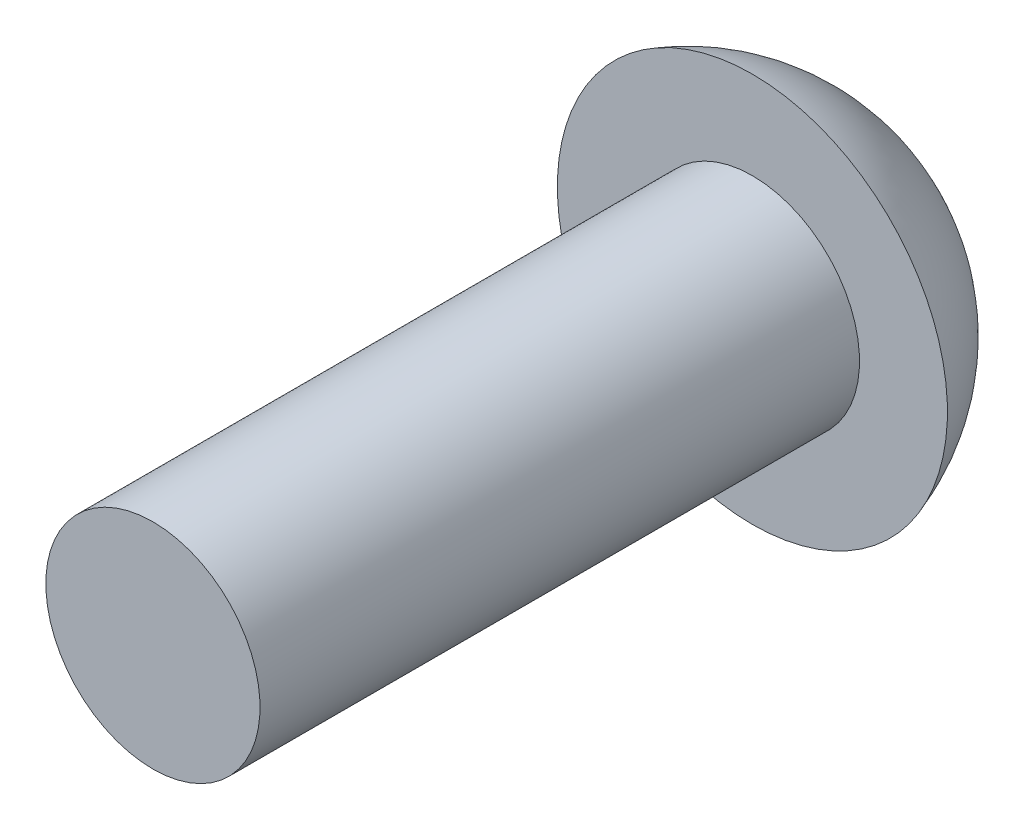
ISO-10303-21;
HEADER;
FILE_DESCRIPTION(('STEP AP214'),'2;1');
FILE_NAME('part.step','',(''),(''),'','','');
FILE_SCHEMA(('AUTOMOTIVE_DESIGN { 1 0 10303 214 1 1 1 1 }'));
ENDSEC;
DATA;
#1=APPLICATION_CONTEXT('core data for automotive mechanical design processes');
#2=APPLICATION_PROTOCOL_DEFINITION('international standard','automotive_design',2000,#1);
#3=PRODUCT_CONTEXT('',#1,'mechanical');
#4=PRODUCT('Part','Part','',(#3));
#5=PRODUCT_RELATED_PRODUCT_CATEGORY('part','',(#4));
#6=PRODUCT_DEFINITION_FORMATION('','',#4);
#7=PRODUCT_DEFINITION_CONTEXT('part definition',#1,'design');
#8=PRODUCT_DEFINITION('design','',#6,#7);
#9=PRODUCT_DEFINITION_SHAPE('','',#8);
#10=(LENGTH_UNIT() NAMED_UNIT(*) SI_UNIT(.MILLI.,.METRE.));
#11=(NAMED_UNIT(*) PLANE_ANGLE_UNIT() SI_UNIT($,.RADIAN.));
#12=(NAMED_UNIT(*) SI_UNIT($,.STERADIAN.) SOLID_ANGLE_UNIT());
#13=UNCERTAINTY_MEASURE_WITH_UNIT(LENGTH_MEASURE(1.E-05),#10,'distance_accuracy_value','');
#14=(GEOMETRIC_REPRESENTATION_CONTEXT(3) GLOBAL_UNCERTAINTY_ASSIGNED_CONTEXT((#13)) GLOBAL_UNIT_ASSIGNED_CONTEXT((#10,
#11,#12)) REPRESENTATION_CONTEXT('',''));
#15=CARTESIAN_POINT('',(0.,0.,0.));
#16=DIRECTION('',(0.,0.,1.));
#17=DIRECTION('',(1.,0.,0.));
#18=AXIS2_PLACEMENT_3D('',#15,#16,#17);
#19=CARTESIAN_POINT('',(0.,0.,-8.49456818181818));
#20=DIRECTION('',(0.,0.,1.));
#21=DIRECTION('',(0.,1.,0.));
#22=AXIS2_PLACEMENT_3D('',#19,#20,#21);
#23=SPHERICAL_SURFACE('',#22,3.26563181818182);
#24=CARTESIAN_POINT('',(0.,0.,-9.525));
#25=DIRECTION('',(0.,0.,1.));
#26=DIRECTION('',(0.,-1.,0.));
#27=AXIS2_PLACEMENT_3D('',#24,#25,#26);
#28=CIRCLE('',#27,3.0988);
#29=CARTESIAN_POINT('',(0.,-3.0988,-9.525));
#30=VERTEX_POINT('',#29);
#31=EDGE_CURVE('E10',#30,#30,#28,.T.);
#32=ORIENTED_EDGE('',*,*,#31,.F.);
#33=EDGE_LOOP('',(#32));
#34=FACE_BOUND('',#33,.T.);
#35=ADVANCED_FACE('F358',(#34),#23,.T.);
#36=CARTESIAN_POINT('',(0.,1.7018,-9.525));
#37=DIRECTION('',(0.,0.,-1.));
#38=DIRECTION('',(0.,1.,0.));
#39=AXIS2_PLACEMENT_3D('',#36,#37,#38);
#40=PLANE('',#39);
#41=CARTESIAN_POINT('',(0.,0.,-9.525));
#42=DIRECTION('',(0.,0.,1.));
#43=DIRECTION('',(0.,-1.,0.));
#44=AXIS2_PLACEMENT_3D('',#41,#42,#43);
#45=CIRCLE('',#44,1.7018);
#46=CARTESIAN_POINT('',(0.,-1.7018,-9.525));
#47=VERTEX_POINT('',#46);
#48=EDGE_CURVE('E364',#47,#47,#45,.T.);
#49=ORIENTED_EDGE('',*,*,#48,.F.);
#50=EDGE_LOOP('',(#49));
#51=FACE_BOUND('',#50,.T.);
#52=ORIENTED_EDGE('',*,*,#31,.T.);
#53=EDGE_LOOP('',(#52));
#54=FACE_BOUND('',#53,.T.);
#55=ADVANCED_FACE('F379',(#51,#54),#40,.F.);
#56=CARTESIAN_POINT('',(0.,0.,0.));
#57=DIRECTION('',(0.,0.,1.));
#58=DIRECTION('',(0.,-1.,0.));
#59=AXIS2_PLACEMENT_3D('',#56,#57,#58);
#60=CYLINDRICAL_SURFACE('',#59,1.7018);
#61=CARTESIAN_POINT('',(0.,0.,0.));
#62=DIRECTION('',(0.,0.,1.));
#63=DIRECTION('',(0.,-1.,0.));
#64=AXIS2_PLACEMENT_3D('',#61,#62,#63);
#65=CIRCLE('',#64,1.7018);
#66=CARTESIAN_POINT('',(0.,-1.7018,0.));
#67=VERTEX_POINT('',#66);
#68=EDGE_CURVE('E368',#67,#67,#65,.T.);
#69=ORIENTED_EDGE('',*,*,#68,.F.);
#70=EDGE_LOOP('',(#69));
#71=FACE_BOUND('',#70,.T.);
#72=ORIENTED_EDGE('',*,*,#48,.T.);
#73=EDGE_LOOP('',(#72));
#74=FACE_BOUND('',#73,.T.);
#75=ADVANCED_FACE('F377',(#71,#74),#60,.T.);
#76=CARTESIAN_POINT('',(0.,0.,0.));
#77=DIRECTION('',(0.,0.,-1.));
#78=DIRECTION('',(0.,1.,0.));
#79=AXIS2_PLACEMENT_3D('',#76,#77,#78);
#80=PLANE('',#79);
#81=ORIENTED_EDGE('',*,*,#68,.T.);
#82=EDGE_LOOP('',(#81));
#83=FACE_BOUND('',#82,.T.);
#84=ADVANCED_FACE('F375',(#83),#80,.F.);
#85=CLOSED_SHELL('',(#35,#55,#75,#84));
#86=MANIFOLD_SOLID_BREP('B2',#85);
#87=ADVANCED_BREP_SHAPE_REPRESENTATION('',(#18,#86),#14);
#88=SHAPE_DEFINITION_REPRESENTATION(#9,#87);
ENDSEC;
END-ISO-10303-21;
